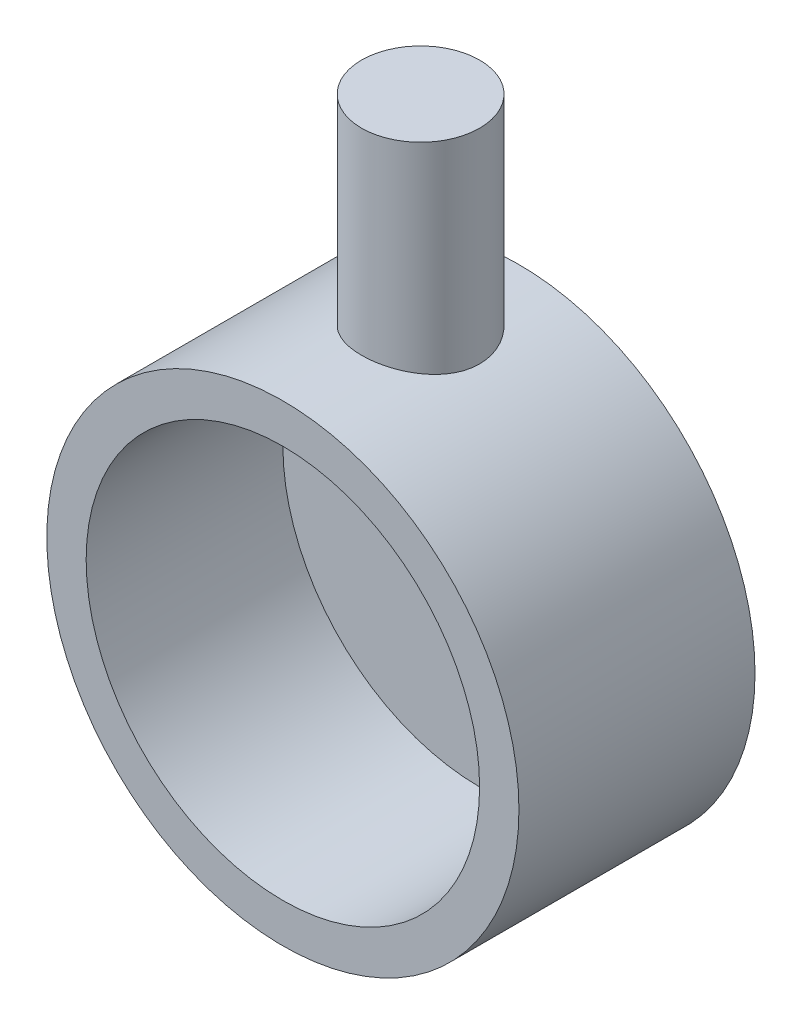
ISO-10303-21;
HEADER;
FILE_DESCRIPTION(('STEP AP214'),'2;1');
FILE_NAME('part.step','',(''),(''),'','','');
FILE_SCHEMA(('AUTOMOTIVE_DESIGN { 1 0 10303 214 1 1 1 1 }'));
ENDSEC;
DATA;
#1=APPLICATION_CONTEXT('core data for automotive mechanical design processes');
#2=APPLICATION_PROTOCOL_DEFINITION('international standard','automotive_design',2000,#1);
#3=PRODUCT_CONTEXT('',#1,'mechanical');
#4=PRODUCT('Part','Part','',(#3));
#5=PRODUCT_RELATED_PRODUCT_CATEGORY('part','',(#4));
#6=PRODUCT_DEFINITION_FORMATION('','',#4);
#7=PRODUCT_DEFINITION_CONTEXT('part definition',#1,'design');
#8=PRODUCT_DEFINITION('design','',#6,#7);
#9=PRODUCT_DEFINITION_SHAPE('','',#8);
#10=(LENGTH_UNIT() NAMED_UNIT(*) SI_UNIT(.MILLI.,.METRE.));
#11=(NAMED_UNIT(*) PLANE_ANGLE_UNIT() SI_UNIT($,.RADIAN.));
#12=(NAMED_UNIT(*) SI_UNIT($,.STERADIAN.) SOLID_ANGLE_UNIT());
#13=UNCERTAINTY_MEASURE_WITH_UNIT(LENGTH_MEASURE(1.E-05),#10,'distance_accuracy_value','');
#14=(GEOMETRIC_REPRESENTATION_CONTEXT(3) GLOBAL_UNCERTAINTY_ASSIGNED_CONTEXT((#13)) GLOBAL_UNIT_ASSIGNED_CONTEXT((#10,
#11,#12)) REPRESENTATION_CONTEXT('',''));
#15=CARTESIAN_POINT('',(0.,0.,0.));
#16=DIRECTION('',(0.,0.,1.));
#17=DIRECTION('',(1.,0.,0.));
#18=AXIS2_PLACEMENT_3D('',#15,#16,#17);
#19=CARTESIAN_POINT('',(0.,0.,30.));
#20=DIRECTION('',(0.,0.,-1.));
#21=DIRECTION('',(-1.,0.,0.));
#22=AXIS2_PLACEMENT_3D('',#19,#20,#21);
#23=CYLINDRICAL_SURFACE('',#22,30.);
#24=CARTESIAN_POINT('',(0.,0.,30.));
#25=DIRECTION('',(0.,0.,1.));
#26=DIRECTION('',(1.,0.,0.));
#27=AXIS2_PLACEMENT_3D('',#24,#25,#26);
#28=CIRCLE('',#27,30.);
#29=CARTESIAN_POINT('',(30.,0.,30.));
#30=VERTEX_POINT('',#29);
#31=EDGE_CURVE('E43',#30,#30,#28,.T.);
#32=ORIENTED_EDGE('',*,*,#31,.F.);
#33=EDGE_LOOP('',(#32));
#34=FACE_BOUND('',#33,.T.);
#35=CARTESIAN_POINT('',(0.,0.,0.));
#36=DIRECTION('',(0.,0.,1.));
#37=DIRECTION('',(1.,0.,0.));
#38=AXIS2_PLACEMENT_3D('',#35,#36,#37);
#39=CIRCLE('',#38,30.);
#40=CARTESIAN_POINT('',(30.,0.,0.));
#41=VERTEX_POINT('',#40);
#42=EDGE_CURVE('E47',#41,#41,#39,.T.);
#43=ORIENTED_EDGE('',*,*,#42,.T.);
#44=EDGE_LOOP('',(#43));
#45=FACE_BOUND('',#44,.T.);
#46=CARTESIAN_POINT('',(0.,30.,5.));
#47=CARTESIAN_POINT('',(-0.207256734254572,30.0000037453459,4.99999381378275));
#48=CARTESIAN_POINT('',(-0.414445772619029,29.9978490421554,5.0085923436149));
#49=CARTESIAN_POINT('',(-0.827372926875365,29.9892986338407,5.0428998275211));
#50=CARTESIAN_POINT('',(-1.0331108745179,29.9829024448411,5.06861073380246));
#51=CARTESIAN_POINT('',(-1.44164335288553,29.9660390935064,5.13694464912004));
#52=CARTESIAN_POINT('',(-1.64443695024209,29.9555706682773,5.17957290469763));
#53=CARTESIAN_POINT('',(-2.04566249050755,29.9308482104685,5.28140490945559));
#54=CARTESIAN_POINT('',(-2.2440927967297,29.9165927827403,5.34061476780873));
#55=CARTESIAN_POINT('',(-2.63482361033415,29.8847130121074,5.47502148921735));
#56=CARTESIAN_POINT('',(-2.82713338772062,29.8670940775137,5.55019270888217));
#57=CARTESIAN_POINT('',(-3.20473275040715,29.8289408904844,5.71603173965251));
#58=CARTESIAN_POINT('',(-3.39001971101989,29.8084055614329,5.8067052761225));
#59=CARTESIAN_POINT('',(-3.7522202755664,29.7649811811595,6.00282816733267));
#60=CARTESIAN_POINT('',(-3.92913691827915,29.742092993849,6.10827210386755));
#61=CARTESIAN_POINT('',(-4.27360568159023,29.6945540671174,6.33326406302083));
#62=CARTESIAN_POINT('',(-4.44115419618483,29.6699026572012,6.45281746235317));
#63=CARTESIAN_POINT('',(-4.76869838853697,29.619039181262,6.70747691806704));
#64=CARTESIAN_POINT('',(-4.92850273427093,29.5928069564233,6.84282509221506));
#65=CARTESIAN_POINT('',(-5.23627158512015,29.5399027992388,7.12642864808341));
#66=CARTESIAN_POINT('',(-5.38423065457483,29.5132306717209,7.27468989104147));
#67=CARTESIAN_POINT('',(-5.66727667516599,29.4601886439759,7.58311183929658));
#68=CARTESIAN_POINT('',(-5.8023621532796,29.4338187786372,7.74327390258751));
#69=CARTESIAN_POINT('',(-6.0586785094097,29.3821290110363,8.07436722799814));
#70=CARTESIAN_POINT('',(-6.17991560837028,29.3568086406046,8.24529360063524));
#71=CARTESIAN_POINT('',(-6.40951409930151,29.3075439341613,8.59956876215479));
#72=CARTESIAN_POINT('',(-6.51764960185278,29.2836266449605,8.78306782310076));
#73=CARTESIAN_POINT('',(-6.71799715274033,29.2383150093389,9.15876988101405));
#74=CARTESIAN_POINT('',(-6.81021539751505,29.2169196821753,9.35096945400637));
#75=CARTESIAN_POINT('',(-6.97807998690055,29.1772830300449,9.74285493103356));
#76=CARTESIAN_POINT('',(-7.05372180053081,29.1590425677112,9.94254286450297));
#77=CARTESIAN_POINT('',(-7.18774907819538,29.1262944152227,10.3478385500686));
#78=CARTESIAN_POINT('',(-7.24614170611682,29.111785175751,10.5534438055521));
#79=CARTESIAN_POINT('',(-7.34423429783446,29.087191868454,10.9650413425531));
#80=CARTESIAN_POINT('',(-7.38427907774648,29.0770264361312,11.1709466033541));
#81=CARTESIAN_POINT('',(-7.44698381998102,29.0610302983691,11.5854757032032));
#82=CARTESIAN_POINT('',(-7.4696505014047,29.0551979176174,11.7940984597918));
#83=CARTESIAN_POINT('',(-7.49742486553878,29.0480434288025,12.2125964710773));
#84=CARTESIAN_POINT('',(-7.50253175108482,29.0467215255021,12.4224717822033));
#85=CARTESIAN_POINT('',(-7.49513850303137,29.0486301556068,12.8418896159627));
#86=CARTESIAN_POINT('',(-7.48263861425261,29.0518606257116,13.0514321431829));
#87=CARTESIAN_POINT('',(-7.44066443989572,29.0626386537169,13.4635107905243));
#88=CARTESIAN_POINT('',(-7.41161271353989,29.0700787116682,13.6660929406869));
#89=CARTESIAN_POINT('',(-7.33708950806224,29.0889771849314,14.0680948332658));
#90=CARTESIAN_POINT('',(-7.29161238858817,29.1004369805509,14.2675134647682));
#91=CARTESIAN_POINT('',(-7.18462456321622,29.1270356051467,14.6616803098363));
#92=CARTESIAN_POINT('',(-7.12311886472078,29.1421732850352,14.8564299613007));
#93=CARTESIAN_POINT('',(-6.98451980658928,29.1757016001342,15.2400915118836));
#94=CARTESIAN_POINT('',(-6.90742060486374,29.1940934541936,15.4290011923924));
#95=CARTESIAN_POINT('',(-6.73739848582151,29.2338015327733,15.8014816069599));
#96=CARTESIAN_POINT('',(-6.64432902465889,29.2551444484012,15.9849825850245));
#97=CARTESIAN_POINT('',(-6.44353389820848,29.3000247863839,16.3435809930789));
#98=CARTESIAN_POINT('',(-6.33580318651136,29.3235629634671,16.5186755013625));
#99=CARTESIAN_POINT('',(-6.10645448231137,29.3721798477543,16.8592851158064));
#100=CARTESIAN_POINT('',(-5.98483682913732,29.3972585173093,17.0248004558859));
#101=CARTESIAN_POINT('',(-5.72851464458562,29.4482799478748,17.345226078394));
#102=CARTESIAN_POINT('',(-5.59380986006435,29.4742227255933,17.5001361555868));
#103=CARTESIAN_POINT('',(-5.30812720402335,29.5270296746379,17.8026694252967));
#104=CARTESIAN_POINT('',(-5.15679305825284,29.5538989083984,17.9499555231284));
#105=CARTESIAN_POINT('',(-4.84224513770858,29.6070614891839,18.2312445537869));
#106=CARTESIAN_POINT('',(-4.67903532063276,29.633355024301,18.3652518770667));
#107=CARTESIAN_POINT('',(-4.34169745900448,29.6846555639648,18.6191705172298));
#108=CARTESIAN_POINT('',(-4.16756501268234,29.7096620423464,18.7390760944818));
#109=CARTESIAN_POINT('',(-3.8096684940054,29.7576713903058,18.963826943288));
#110=CARTESIAN_POINT('',(-3.62590818010506,29.7806750325377,19.0686780327863));
#111=CARTESIAN_POINT('',(-3.24921184124927,29.8241295151946,19.2629657271624));
#112=CARTESIAN_POINT('',(-3.05624322556213,29.8445701905708,19.3523414571352));
#113=CARTESIAN_POINT('',(-2.66321164273137,29.8822063507743,19.5144475012624));
#114=CARTESIAN_POINT('',(-2.4631513365378,29.8994030378182,19.5871839840282));
#115=CARTESIAN_POINT('',(-2.05730133669796,29.9300671893901,19.7154558992337));
#116=CARTESIAN_POINT('',(-1.85151145550623,29.9435345316876,19.7709907678921));
#117=CARTESIAN_POINT('',(-1.43573434643275,29.9663479171876,19.8643778655856));
#118=CARTESIAN_POINT('',(-1.22574722216535,29.9756940619961,19.9022305305679));
#119=CARTESIAN_POINT('',(-0.808578683807364,29.9898089145492,19.9591808363089));
#120=CARTESIAN_POINT('',(-0.601463095698465,29.9946886976466,19.9787338726344));
#121=CARTESIAN_POINT('',(-0.186267995157772,30.0001400772457,20.0005678376777));
#122=CARTESIAN_POINT('',(0.0218115019769044,30.000711741884,20.0028490395643));
#123=CARTESIAN_POINT('',(0.437389325214038,29.9975310207239,19.99012046619));
#124=CARTESIAN_POINT('',(0.644887698412755,29.9937789961322,19.9751121353194));
#125=CARTESIAN_POINT('',(1.05780268491359,29.9820565166686,19.9279360582057));
#126=CARTESIAN_POINT('',(1.26321930635195,29.9740860782903,19.8957683790541));
#127=CARTESIAN_POINT('',(1.66742320422338,29.9542990466074,19.8151576333888));
#128=CARTESIAN_POINT('',(1.86626371494322,29.9425420528386,19.7669664159315));
#129=CARTESIAN_POINT('',(2.2591874263201,29.9154620308896,19.6545679298331));
#130=CARTESIAN_POINT('',(2.45326899198192,29.9001377955994,19.5903552391965));
#131=CARTESIAN_POINT('',(2.83525089394274,29.8663374011303,19.4464377499296));
#132=CARTESIAN_POINT('',(3.02315294909721,29.8478621274231,19.3667373026322));
#133=CARTESIAN_POINT('',(3.39167896910061,29.8082350586212,19.1923899358119));
#134=CARTESIAN_POINT('',(3.57230017520984,29.7870822613409,19.0977374164859));
#135=CARTESIAN_POINT('',(3.92811410360477,29.7422701230095,18.8924049294172));
#136=CARTESIAN_POINT('',(4.10315786453243,29.7185735994032,18.7814749358635));
#137=CARTESIAN_POINT('',(4.44338343365207,29.6696123625192,18.5455941336559));
#138=CARTESIAN_POINT('',(4.60856179442652,29.6443471072734,18.4206384672099));
#139=CARTESIAN_POINT('',(4.92794065130361,29.5929310301235,18.1575790598029));
#140=CARTESIAN_POINT('',(5.08214133154538,29.5667802230844,18.0194755394743));
#141=CARTESIAN_POINT('',(5.37858986672457,29.5142920657744,17.7310176025902));
#142=CARTESIAN_POINT('',(5.52083758628275,29.4879547133942,17.5806630473175));
#143=CARTESIAN_POINT('',(5.79583124003957,29.4351563606738,17.2647944235213));
#144=CARTESIAN_POINT('',(5.92825459803295,29.4087084526847,17.0989971320639));
#145=CARTESIAN_POINT('',(6.17862451598173,29.3571275246933,16.7567060090605));
#146=CARTESIAN_POINT('',(6.2965760410501,29.3319940554304,16.580215877319));
#147=CARTESIAN_POINT('',(6.51724566861914,29.2837544538572,16.2176026123429));
#148=CARTESIAN_POINT('',(6.61995840151205,29.2606490373261,16.0314761146121));
#149=CARTESIAN_POINT('',(6.80928641924751,29.2171705487862,15.6509922581158));
#150=CARTESIAN_POINT('',(6.89590814708461,29.1967963840713,15.4566382321753));
#151=CARTESIAN_POINT('',(7.05197723932848,29.1594928518965,15.0621020847052));
#152=CARTESIAN_POINT('',(7.12151832737372,29.142544780169,14.8619588257643));
#153=CARTESIAN_POINT('',(7.24345651216678,29.1124764442986,14.4563160459165));
#154=CARTESIAN_POINT('',(7.29586020933086,29.0993547066657,14.2508186201538));
#155=CARTESIAN_POINT('',(7.38310953761381,29.0773403452908,13.835902482939));
#156=CARTESIAN_POINT('',(7.41795501871784,29.0684477576821,13.6264837379997));
#157=CARTESIAN_POINT('',(7.46977632397465,29.0551744235845,13.2053064977937));
#158=CARTESIAN_POINT('',(7.48675257805306,29.0507935685455,12.993548058943));
#159=CARTESIAN_POINT('',(7.50245275501607,29.0467427280977,12.5754519621045));
#160=CARTESIAN_POINT('',(7.50169050219217,29.0469401256905,12.3691347081206));
#161=CARTESIAN_POINT('',(7.48317627143566,29.0517153474306,11.9572424145886));
#162=CARTESIAN_POINT('',(7.46541843430736,29.0562946822425,11.7516676555484));
#163=CARTESIAN_POINT('',(7.41306667528966,29.0696950370366,11.3428977879835));
#164=CARTESIAN_POINT('',(7.37847936764755,29.0785143906083,11.1397017766752));
#165=CARTESIAN_POINT('',(7.2927454273818,29.1001342961677,10.7369725886938));
#166=CARTESIAN_POINT('',(7.24159263281378,29.1129363295422,10.5374408042511));
#167=CARTESIAN_POINT('',(7.12352281554543,29.1420502241293,10.144751900886));
#168=CARTESIAN_POINT('',(7.0567078563359,29.1583393045388,9.95156237232492));
#169=CARTESIAN_POINT('',(6.90762983393255,29.1940151713161,9.57146100934892));
#170=CARTESIAN_POINT('',(6.82536149362095,29.2134030155311,9.38455134520129));
#171=CARTESIAN_POINT('',(6.64600134575064,29.2547283332099,9.01829902404264));
#172=CARTESIAN_POINT('',(6.54891059096671,29.2766656255706,8.83895583077025));
#173=CARTESIAN_POINT('',(6.34057791264134,29.3224903932774,8.48894627390186));
#174=CARTESIAN_POINT('',(6.2293356006946,29.3463779221434,8.31828014863771));
#175=CARTESIAN_POINT('',(5.99034243964055,29.3961065190916,7.98232348834158));
#176=CARTESIAN_POINT('',(5.86223474325166,29.42198241748,7.81729186526728));
#177=CARTESIAN_POINT('',(5.59280739993017,29.4743842744133,7.49859694674386));
#178=CARTESIAN_POINT('',(5.45149196693633,29.5009100236431,7.34493005320792));
#179=CARTESIAN_POINT('',(5.15645532971095,29.5539073425417,7.04981397793339));
#180=CARTESIAN_POINT('',(5.00272698747203,29.580378871931,6.90837192423656));
#181=CARTESIAN_POINT('',(4.68398990056901,29.6325210396486,6.63878930382745));
#182=CARTESIAN_POINT('',(4.51898526780472,29.6581919649966,6.51064393095447));
#183=CARTESIAN_POINT('',(4.17555233782097,29.7085076706245,6.26622101031834));
#184=CARTESIAN_POINT('',(3.99693193174417,29.7331246154161,6.15020742916095));
#185=CARTESIAN_POINT('',(3.6303206697245,29.7801093561847,5.93371662818199));
#186=CARTESIAN_POINT('',(3.44233329237778,29.8024779779427,5.83323369680218));
#187=CARTESIAN_POINT('',(3.05829616105568,29.8443309638024,5.64856314103614));
#188=CARTESIAN_POINT('',(2.86224992693636,29.8638165703651,5.56436849223059));
#189=CARTESIAN_POINT('',(2.46348752288632,29.8993536986122,5.412917055638));
#190=CARTESIAN_POINT('',(2.26077236435609,29.9154057382819,5.34565771273141));
#191=CARTESIAN_POINT('',(1.72222038090992,29.9523811960307,5.19220893261738));
#192=CARTESIAN_POINT('',(1.38198934082177,29.9701268439889,5.1202557776984));
#193=CARTESIAN_POINT('',(0.694441878056029,29.9939326700618,5.02415828982685));
#194=CARTESIAN_POINT('',(0.347125990274128,29.9999937270705,5.00001036104713));
#195=CARTESIAN_POINT('',(0.,30.,5.));
#196=B_SPLINE_CURVE_WITH_KNOTS('',3,(#46,#47,#48,#49,#50,#51,#52,#53,#54,#55,#56,#57,#58,#59,
#60,#61,#62,#63,#64,#65,#66,#67,#68,#69,#70,#71,#72,#73,#74,#75,#76,#77,#78,#79,#80,#81,#82,#83,
#84,#85,#86,#87,#88,#89,#90,#91,#92,#93,#94,#95,#96,#97,#98,#99,#100,#101,#102,#103,#104,#105,
#106,#107,#108,#109,#110,#111,#112,#113,#114,#115,#116,#117,#118,#119,#120,#121,#122,#123,#124,
#125,#126,#127,#128,#129,#130,#131,#132,#133,#134,#135,#136,#137,#138,#139,#140,#141,#142,#143,
#144,#145,#146,#147,#148,#149,#150,#151,#152,#153,#154,#155,#156,#157,#158,#159,#160,#161,#162,
#163,#164,#165,#166,#167,#168,#169,#170,#171,#172,#173,#174,#175,#176,#177,#178,#179,#180,#181,
#182,#183,#184,#185,#186,#187,#188,#189,#190,#191,#192,#193,#194,#195),.UNSPECIFIED.,.T.,.F.,(4,
2,2,2,2,2,2,2,2,2,2,2,2,2,2,2,2,2,2,2,2,2,2,2,2,2,2,2,2,2,2,2,2,2,2,2,2,2,2,2,2,2,2,2,2,2,2,2,2,
2,2,2,2,2,2,2,2,2,2,2,2,2,2,2,2,2,2,2,2,2,2,2,2,2,4),(0.,0.621464317010413,1.24299954382043,
1.86472767684074,2.48668517567918,3.10765090273786,3.72884646419194,4.34981474719268,
4.97102043224859,5.60345785394206,6.23618384989133,6.86898215694611,7.5014950721497,
8.14370490718989,8.78566416935039,9.42779868557194,10.0696661359821,10.698918856558,
11.3279281587941,11.9569660158719,12.5859951263177,13.1996422302774,13.813500256537,
14.427166740115,15.0410635604956,15.6609283810618,16.2810071015708,16.9010706736347,
17.5211462419402,18.1590318968172,18.7967059344352,19.4346386236679,20.072324110567,
20.7124637031903,21.3523655930574,21.9922884534341,22.6321955359513,23.2557181786969,
23.8792309598843,24.502691655776,25.1261499140133,25.7402389224971,26.3545360338667,
26.9686608054559,27.5830161248213,28.2080518295537,28.8333046873219,29.4585470546531,
30.0837965025261,30.7245311303908,31.3650453114752,32.0057846536417,32.6462668819265,
33.2831519874562,33.9197915088559,34.5564364695181,35.1930661124365,35.8112783348089,
36.4297037614805,37.0478863332832,37.6662991180849,38.2807888234882,38.8954887514426,
39.5101450400984,40.1248182023236,40.7556352414596,41.3862517005309,42.0172334122502,
42.6479862516882,43.2904290553219,43.9326350288529,44.5745634267956,45.2163949154785,
46.2573388715185,47.298204526563),.UNSPECIFIED.);
#197=CARTESIAN_POINT('',(0.,30.,5.));
#198=VERTEX_POINT('',#197);
#199=EDGE_CURVE('E10',#198,#198,#196,.T.);
#200=ORIENTED_EDGE('',*,*,#199,.F.);
#201=EDGE_LOOP('',(#200));
#202=FACE_BOUND('',#201,.T.);
#203=ADVANCED_FACE('F32',(#34,#45,#202),#23,.T.);
#204=CARTESIAN_POINT('',(0.,0.,30.));
#205=DIRECTION('',(0.,0.,1.));
#206=DIRECTION('',(1.,0.,0.));
#207=AXIS2_PLACEMENT_3D('',#204,#205,#206);
#208=PLANE('',#207);
#209=CARTESIAN_POINT('',(0.,0.,30.));
#210=DIRECTION('',(0.,0.,1.));
#211=DIRECTION('',(1.,0.,0.));
#212=AXIS2_PLACEMENT_3D('',#209,#210,#211);
#213=CIRCLE('',#212,25.);
#214=CARTESIAN_POINT('',(25.,0.,30.));
#215=VERTEX_POINT('',#214);
#216=EDGE_CURVE('E57',#215,#215,#213,.T.);
#217=ORIENTED_EDGE('',*,*,#216,.F.);
#218=EDGE_LOOP('',(#217));
#219=FACE_BOUND('',#218,.T.);
#220=ORIENTED_EDGE('',*,*,#31,.T.);
#221=EDGE_LOOP('',(#220));
#222=FACE_BOUND('',#221,.T.);
#223=ADVANCED_FACE('F72',(#219,#222),#208,.T.);
#224=CARTESIAN_POINT('',(0.,0.,0.));
#225=DIRECTION('',(0.,0.,1.));
#226=DIRECTION('',(1.,0.,0.));
#227=AXIS2_PLACEMENT_3D('',#224,#225,#226);
#228=PLANE('',#227);
#229=ORIENTED_EDGE('',*,*,#42,.F.);
#230=EDGE_LOOP('',(#229));
#231=FACE_BOUND('',#230,.T.);
#232=ADVANCED_FACE('F74',(#231),#228,.F.);
#233=CARTESIAN_POINT('',(0.,55.,12.5));
#234=DIRECTION('',(0.,-1.,0.));
#235=DIRECTION('',(0.,0.,-1.));
#236=AXIS2_PLACEMENT_3D('',#233,#234,#235);
#237=CYLINDRICAL_SURFACE('',#236,7.5);
#238=CARTESIAN_POINT('',(0.,55.,12.5));
#239=DIRECTION('',(0.,1.,0.));
#240=DIRECTION('',(0.,0.,1.));
#241=AXIS2_PLACEMENT_3D('',#238,#239,#240);
#242=CIRCLE('',#241,7.5);
#243=CARTESIAN_POINT('',(0.,55.,20.));
#244=VERTEX_POINT('',#243);
#245=EDGE_CURVE('E52',#244,#244,#242,.T.);
#246=ORIENTED_EDGE('',*,*,#245,.F.);
#247=EDGE_LOOP('',(#246));
#248=FACE_BOUND('',#247,.T.);
#249=ORIENTED_EDGE('',*,*,#199,.T.);
#250=EDGE_LOOP('',(#249));
#251=FACE_BOUND('',#250,.T.);
#252=ADVANCED_FACE('F80',(#248,#251),#237,.T.);
#253=CARTESIAN_POINT('',(0.,55.,12.5));
#254=DIRECTION('',(0.,1.,0.));
#255=DIRECTION('',(0.,0.,1.));
#256=AXIS2_PLACEMENT_3D('',#253,#254,#255);
#257=PLANE('',#256);
#258=ORIENTED_EDGE('',*,*,#245,.T.);
#259=EDGE_LOOP('',(#258));
#260=FACE_BOUND('',#259,.T.);
#261=ADVANCED_FACE('F68',(#260),#257,.T.);
#262=CARTESIAN_POINT('',(0.,0.,5.));
#263=DIRECTION('',(0.,0.,1.));
#264=DIRECTION('',(1.,0.,0.));
#265=AXIS2_PLACEMENT_3D('',#262,#263,#264);
#266=CYLINDRICAL_SURFACE('',#265,25.);
#267=CARTESIAN_POINT('',(0.,0.,5.));
#268=DIRECTION('',(0.,0.,1.));
#269=DIRECTION('',(1.,0.,0.));
#270=AXIS2_PLACEMENT_3D('',#267,#268,#269);
#271=CIRCLE('',#270,25.);
#272=CARTESIAN_POINT('',(25.,0.,5.));
#273=VERTEX_POINT('',#272);
#274=EDGE_CURVE('E56',#273,#273,#271,.T.);
#275=ORIENTED_EDGE('',*,*,#274,.F.);
#276=EDGE_LOOP('',(#275));
#277=FACE_BOUND('',#276,.T.);
#278=ORIENTED_EDGE('',*,*,#216,.T.);
#279=EDGE_LOOP('',(#278));
#280=FACE_BOUND('',#279,.T.);
#281=ADVANCED_FACE('F65',(#277,#280),#266,.F.);
#282=CARTESIAN_POINT('',(0.,0.,5.));
#283=DIRECTION('',(0.,0.,1.));
#284=DIRECTION('',(1.,0.,0.));
#285=AXIS2_PLACEMENT_3D('',#282,#283,#284);
#286=PLANE('',#285);
#287=ORIENTED_EDGE('',*,*,#274,.T.);
#288=EDGE_LOOP('',(#287));
#289=FACE_BOUND('',#288,.T.);
#290=ADVANCED_FACE('F63',(#289),#286,.T.);
#291=CLOSED_SHELL('',(#203,#223,#232,#252,#261,#281,#290));
#292=MANIFOLD_SOLID_BREP('B2',#291);
#293=ADVANCED_BREP_SHAPE_REPRESENTATION('',(#18,#292),#14);
#294=SHAPE_DEFINITION_REPRESENTATION(#9,#293);
ENDSEC;
END-ISO-10303-21;
